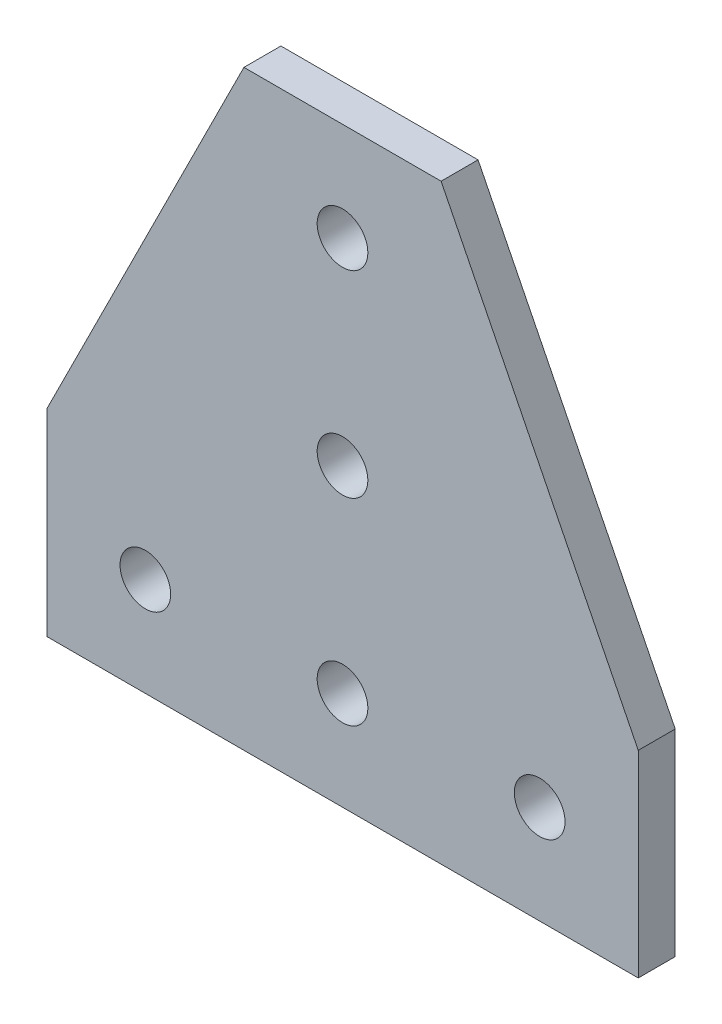
ISO-10303-21;
HEADER;
FILE_DESCRIPTION(('STEP AP214'),'2;1');
FILE_NAME('part.step','',(''),(''),'','','');
FILE_SCHEMA(('AUTOMOTIVE_DESIGN { 1 0 10303 214 1 1 1 1 }'));
ENDSEC;
DATA;
#1=APPLICATION_CONTEXT('core data for automotive mechanical design processes');
#2=APPLICATION_PROTOCOL_DEFINITION('international standard','automotive_design',2000,#1);
#3=PRODUCT_CONTEXT('',#1,'mechanical');
#4=PRODUCT('Part','Part','',(#3));
#5=PRODUCT_RELATED_PRODUCT_CATEGORY('part','',(#4));
#6=PRODUCT_DEFINITION_FORMATION('','',#4);
#7=PRODUCT_DEFINITION_CONTEXT('part definition',#1,'design');
#8=PRODUCT_DEFINITION('design','',#6,#7);
#9=PRODUCT_DEFINITION_SHAPE('','',#8);
#10=(LENGTH_UNIT() NAMED_UNIT(*) SI_UNIT(.MILLI.,.METRE.));
#11=(NAMED_UNIT(*) PLANE_ANGLE_UNIT() SI_UNIT($,.RADIAN.));
#12=(NAMED_UNIT(*) SI_UNIT($,.STERADIAN.) SOLID_ANGLE_UNIT());
#13=UNCERTAINTY_MEASURE_WITH_UNIT(LENGTH_MEASURE(1.E-05),#10,'distance_accuracy_value','');
#14=(GEOMETRIC_REPRESENTATION_CONTEXT(3) GLOBAL_UNCERTAINTY_ASSIGNED_CONTEXT((#13)) GLOBAL_UNIT_ASSIGNED_CONTEXT((#10,
#11,#12)) REPRESENTATION_CONTEXT('',''));
#15=CARTESIAN_POINT('',(0.,0.,0.));
#16=DIRECTION('',(0.,0.,1.));
#17=DIRECTION('',(1.,0.,0.));
#18=AXIS2_PLACEMENT_3D('',#15,#16,#17);
#19=CARTESIAN_POINT('',(0.,0.,2.38125));
#20=DIRECTION('',(0.,0.,-1.));
#21=DIRECTION('',(-1.,0.,0.));
#22=AXIS2_PLACEMENT_3D('',#19,#20,#21);
#23=PLANE('',#22);
#24=CARTESIAN_POINT('',(38.1,63.5,2.38125));
#25=DIRECTION('',(0.,0.,1.));
#26=DIRECTION('',(1.,0.,0.));
#27=AXIS2_PLACEMENT_3D('',#24,#25,#26);
#28=CIRCLE('',#27,3.26390000000001);
#29=CARTESIAN_POINT('',(41.3639,63.5,2.38125));
#30=VERTEX_POINT('',#29);
#31=EDGE_CURVE('E197',#30,#30,#28,.T.);
#32=ORIENTED_EDGE('',*,*,#31,.F.);
#33=EDGE_LOOP('',(#32));
#34=FACE_BOUND('',#33,.T.);
#35=CARTESIAN_POINT('',(38.1,12.7,2.38125));
#36=DIRECTION('',(0.,0.,1.));
#37=DIRECTION('',(1.,0.,0.));
#38=AXIS2_PLACEMENT_3D('',#35,#36,#37);
#39=CIRCLE('',#38,3.26389999999999);
#40=CARTESIAN_POINT('',(41.3639,12.7,2.38125));
#41=VERTEX_POINT('',#40);
#42=EDGE_CURVE('E209',#41,#41,#39,.T.);
#43=ORIENTED_EDGE('',*,*,#42,.F.);
#44=EDGE_LOOP('',(#43));
#45=FACE_BOUND('',#44,.T.);
#46=DIRECTION('',(1.,0.,0.));
#47=VECTOR('',#46,1.);
#48=CARTESIAN_POINT('',(76.2,0.,2.38125));
#49=LINE('',#48,#47);
#50=CARTESIAN_POINT('',(0.,0.,2.38125));
#51=VERTEX_POINT('',#50);
#52=CARTESIAN_POINT('',(76.2,0.,2.38125));
#53=VERTEX_POINT('',#52);
#54=EDGE_CURVE('E132',#51,#53,#49,.T.);
#55=ORIENTED_EDGE('',*,*,#54,.T.);
#56=DIRECTION('',(0.,1.,0.));
#57=VECTOR('',#56,1.);
#58=CARTESIAN_POINT('',(76.2,25.4,2.38125));
#59=LINE('',#58,#57);
#60=CARTESIAN_POINT('',(76.2,25.4,2.38125));
#61=VERTEX_POINT('',#60);
#62=EDGE_CURVE('E90',#53,#61,#59,.T.);
#63=ORIENTED_EDGE('',*,*,#62,.T.);
#64=DIRECTION('',(-0.447213595499958,0.894427190999916,0.));
#65=VECTOR('',#64,1.);
#66=CARTESIAN_POINT('',(76.2,25.4,2.38125));
#67=LINE('',#66,#65);
#68=CARTESIAN_POINT('',(50.8,76.2,2.38125));
#69=VERTEX_POINT('',#68);
#70=EDGE_CURVE('E103',#61,#69,#67,.T.);
#71=ORIENTED_EDGE('',*,*,#70,.T.);
#72=DIRECTION('',(-1.,0.,0.));
#73=VECTOR('',#72,1.);
#74=CARTESIAN_POINT('',(25.4,76.2,2.38125));
#75=LINE('',#74,#73);
#76=CARTESIAN_POINT('',(25.4,76.2,2.38125));
#77=VERTEX_POINT('',#76);
#78=EDGE_CURVE('E97',#69,#77,#75,.T.);
#79=ORIENTED_EDGE('',*,*,#78,.T.);
#80=DIRECTION('',(-0.447213595499958,-0.894427190999916,0.));
#81=VECTOR('',#80,1.);
#82=CARTESIAN_POINT('',(0.,25.4,2.38125));
#83=LINE('',#82,#81);
#84=CARTESIAN_POINT('',(0.,25.4,2.38125));
#85=VERTEX_POINT('',#84);
#86=EDGE_CURVE('E101',#77,#85,#83,.T.);
#87=ORIENTED_EDGE('',*,*,#86,.T.);
#88=DIRECTION('',(0.,-1.,0.));
#89=VECTOR('',#88,1.);
#90=CARTESIAN_POINT('',(0.,0.,2.38125));
#91=LINE('',#90,#89);
#92=EDGE_CURVE('E53',#85,#51,#91,.T.);
#93=ORIENTED_EDGE('',*,*,#92,.T.);
#94=EDGE_LOOP('',(#55,#63,#71,#79,#87,#93));
#95=FACE_BOUND('',#94,.T.);
#96=CARTESIAN_POINT('',(12.7,12.7,2.38125));
#97=DIRECTION('',(0.,0.,1.));
#98=DIRECTION('',(1.,0.,0.));
#99=AXIS2_PLACEMENT_3D('',#96,#97,#98);
#100=CIRCLE('',#99,3.2639);
#101=CARTESIAN_POINT('',(15.9639,12.7,2.38125));
#102=VERTEX_POINT('',#101);
#103=EDGE_CURVE('E125',#102,#102,#100,.T.);
#104=ORIENTED_EDGE('',*,*,#103,.F.);
#105=EDGE_LOOP('',(#104));
#106=FACE_BOUND('',#105,.T.);
#107=CARTESIAN_POINT('',(63.5,12.7,2.38125));
#108=DIRECTION('',(0.,0.,1.));
#109=DIRECTION('',(1.,0.,0.));
#110=AXIS2_PLACEMENT_3D('',#107,#108,#109);
#111=CIRCLE('',#110,3.26389999999999);
#112=CARTESIAN_POINT('',(66.7639,12.7,2.38125));
#113=VERTEX_POINT('',#112);
#114=EDGE_CURVE('E203',#113,#113,#111,.T.);
#115=ORIENTED_EDGE('',*,*,#114,.F.);
#116=EDGE_LOOP('',(#115));
#117=FACE_BOUND('',#116,.T.);
#118=CARTESIAN_POINT('',(38.1,38.1,2.38125));
#119=DIRECTION('',(0.,0.,1.));
#120=DIRECTION('',(1.,0.,0.));
#121=AXIS2_PLACEMENT_3D('',#118,#119,#120);
#122=CIRCLE('',#121,3.26389999999999);
#123=CARTESIAN_POINT('',(41.3639,38.1,2.38125));
#124=VERTEX_POINT('',#123);
#125=EDGE_CURVE('E188',#124,#124,#122,.T.);
#126=ORIENTED_EDGE('',*,*,#125,.F.);
#127=EDGE_LOOP('',(#126));
#128=FACE_BOUND('',#127,.T.);
#129=ADVANCED_FACE('F36',(#34,#45,#95,#106,#117,#128),#23,.F.);
#130=CARTESIAN_POINT('',(0.,0.,-2.38125));
#131=DIRECTION('',(0.,0.,-1.));
#132=DIRECTION('',(-1.,0.,0.));
#133=AXIS2_PLACEMENT_3D('',#130,#131,#132);
#134=PLANE('',#133);
#135=CARTESIAN_POINT('',(38.1,63.5,-2.38125));
#136=DIRECTION('',(0.,0.,1.));
#137=DIRECTION('',(1.,0.,0.));
#138=AXIS2_PLACEMENT_3D('',#135,#136,#137);
#139=CIRCLE('',#138,3.26390000000001);
#140=CARTESIAN_POINT('',(41.3639,63.5,-2.38125));
#141=VERTEX_POINT('',#140);
#142=EDGE_CURVE('E194',#141,#141,#139,.T.);
#143=ORIENTED_EDGE('',*,*,#142,.T.);
#144=EDGE_LOOP('',(#143));
#145=FACE_BOUND('',#144,.T.);
#146=CARTESIAN_POINT('',(38.1,12.7,-2.38125));
#147=DIRECTION('',(0.,0.,1.));
#148=DIRECTION('',(1.,0.,0.));
#149=AXIS2_PLACEMENT_3D('',#146,#147,#148);
#150=CIRCLE('',#149,3.26389999999999);
#151=CARTESIAN_POINT('',(41.3639,12.7,-2.38125));
#152=VERTEX_POINT('',#151);
#153=EDGE_CURVE('E206',#152,#152,#150,.T.);
#154=ORIENTED_EDGE('',*,*,#153,.T.);
#155=EDGE_LOOP('',(#154));
#156=FACE_BOUND('',#155,.T.);
#157=DIRECTION('',(1.,0.,0.));
#158=VECTOR('',#157,1.);
#159=CARTESIAN_POINT('',(76.2,0.,-2.38125));
#160=LINE('',#159,#158);
#161=CARTESIAN_POINT('',(0.,0.,-2.38125));
#162=VERTEX_POINT('',#161);
#163=CARTESIAN_POINT('',(76.2,0.,-2.38125));
#164=VERTEX_POINT('',#163);
#165=EDGE_CURVE('E121',#162,#164,#160,.T.);
#166=ORIENTED_EDGE('',*,*,#165,.F.);
#167=DIRECTION('',(0.,-1.,0.));
#168=VECTOR('',#167,1.);
#169=CARTESIAN_POINT('',(0.,0.,-2.38125));
#170=LINE('',#169,#168);
#171=CARTESIAN_POINT('',(0.,25.4,-2.38125));
#172=VERTEX_POINT('',#171);
#173=EDGE_CURVE('E82',#172,#162,#170,.T.);
#174=ORIENTED_EDGE('',*,*,#173,.F.);
#175=DIRECTION('',(-0.447213595499958,-0.894427190999916,0.));
#176=VECTOR('',#175,1.);
#177=CARTESIAN_POINT('',(0.,25.4,-2.38125));
#178=LINE('',#177,#176);
#179=CARTESIAN_POINT('',(25.4,76.2,-2.38125));
#180=VERTEX_POINT('',#179);
#181=EDGE_CURVE('E76',#180,#172,#178,.T.);
#182=ORIENTED_EDGE('',*,*,#181,.F.);
#183=DIRECTION('',(-1.,0.,0.));
#184=VECTOR('',#183,1.);
#185=CARTESIAN_POINT('',(25.4,76.2,-2.38125));
#186=LINE('',#185,#184);
#187=CARTESIAN_POINT('',(50.8,76.2,-2.38125));
#188=VERTEX_POINT('',#187);
#189=EDGE_CURVE('E111',#188,#180,#186,.T.);
#190=ORIENTED_EDGE('',*,*,#189,.F.);
#191=DIRECTION('',(-0.447213595499958,0.894427190999916,0.));
#192=VECTOR('',#191,1.);
#193=CARTESIAN_POINT('',(76.2,25.4,-2.38125));
#194=LINE('',#193,#192);
#195=CARTESIAN_POINT('',(76.2,25.4,-2.38125));
#196=VERTEX_POINT('',#195);
#197=EDGE_CURVE('E127',#196,#188,#194,.T.);
#198=ORIENTED_EDGE('',*,*,#197,.F.);
#199=DIRECTION('',(0.,1.,0.));
#200=VECTOR('',#199,1.);
#201=CARTESIAN_POINT('',(76.2,25.4,-2.38125));
#202=LINE('',#201,#200);
#203=EDGE_CURVE('E124',#164,#196,#202,.T.);
#204=ORIENTED_EDGE('',*,*,#203,.F.);
#205=EDGE_LOOP('',(#166,#174,#182,#190,#198,#204));
#206=FACE_BOUND('',#205,.T.);
#207=CARTESIAN_POINT('',(12.7,12.7,-2.38125));
#208=DIRECTION('',(0.,0.,1.));
#209=DIRECTION('',(1.,0.,0.));
#210=AXIS2_PLACEMENT_3D('',#207,#208,#209);
#211=CIRCLE('',#210,3.2639);
#212=CARTESIAN_POINT('',(15.9639,12.7,-2.38125));
#213=VERTEX_POINT('',#212);
#214=EDGE_CURVE('E212',#213,#213,#211,.T.);
#215=ORIENTED_EDGE('',*,*,#214,.T.);
#216=EDGE_LOOP('',(#215));
#217=FACE_BOUND('',#216,.T.);
#218=CARTESIAN_POINT('',(63.5,12.7,-2.38125));
#219=DIRECTION('',(0.,0.,1.));
#220=DIRECTION('',(1.,0.,0.));
#221=AXIS2_PLACEMENT_3D('',#218,#219,#220);
#222=CIRCLE('',#221,3.26389999999999);
#223=CARTESIAN_POINT('',(66.7639,12.7,-2.38125));
#224=VERTEX_POINT('',#223);
#225=EDGE_CURVE('E200',#224,#224,#222,.T.);
#226=ORIENTED_EDGE('',*,*,#225,.T.);
#227=EDGE_LOOP('',(#226));
#228=FACE_BOUND('',#227,.T.);
#229=CARTESIAN_POINT('',(38.1,38.1,-2.38125));
#230=DIRECTION('',(0.,0.,1.));
#231=DIRECTION('',(1.,0.,0.));
#232=AXIS2_PLACEMENT_3D('',#229,#230,#231);
#233=CIRCLE('',#232,3.26389999999999);
#234=CARTESIAN_POINT('',(41.3639,38.1,-2.38125));
#235=VERTEX_POINT('',#234);
#236=EDGE_CURVE('E191',#235,#235,#233,.T.);
#237=ORIENTED_EDGE('',*,*,#236,.T.);
#238=EDGE_LOOP('',(#237));
#239=FACE_BOUND('',#238,.T.);
#240=ADVANCED_FACE('F141',(#145,#156,#206,#217,#228,#239),#134,.T.);
#241=CARTESIAN_POINT('',(76.2,0.,2.38125));
#242=DIRECTION('',(0.,1.,0.));
#243=DIRECTION('',(-1.,0.,0.));
#244=AXIS2_PLACEMENT_3D('',#241,#242,#243);
#245=PLANE('',#244);
#246=ORIENTED_EDGE('',*,*,#165,.T.);
#247=DIRECTION('',(0.,0.,-1.));
#248=VECTOR('',#247,1.);
#249=CARTESIAN_POINT('',(76.2,0.,2.38125));
#250=LINE('',#249,#248);
#251=EDGE_CURVE('E11',#53,#164,#250,.T.);
#252=ORIENTED_EDGE('',*,*,#251,.F.);
#253=ORIENTED_EDGE('',*,*,#54,.F.);
#254=DIRECTION('',(0.,0.,-1.));
#255=VECTOR('',#254,1.);
#256=CARTESIAN_POINT('',(0.,0.,2.38125));
#257=LINE('',#256,#255);
#258=EDGE_CURVE('E117',#51,#162,#257,.T.);
#259=ORIENTED_EDGE('',*,*,#258,.T.);
#260=EDGE_LOOP('',(#246,#252,#253,#259));
#261=FACE_BOUND('',#260,.T.);
#262=ADVANCED_FACE('F38',(#261),#245,.F.);
#263=CARTESIAN_POINT('',(76.2,25.4,2.38125));
#264=DIRECTION('',(-1.,0.,0.));
#265=DIRECTION('',(0.,0.,1.));
#266=AXIS2_PLACEMENT_3D('',#263,#264,#265);
#267=PLANE('',#266);
#268=ORIENTED_EDGE('',*,*,#203,.T.);
#269=DIRECTION('',(0.,0.,-1.));
#270=VECTOR('',#269,1.);
#271=CARTESIAN_POINT('',(76.2,25.4,2.38125));
#272=LINE('',#271,#270);
#273=EDGE_CURVE('E45',#61,#196,#272,.T.);
#274=ORIENTED_EDGE('',*,*,#273,.F.);
#275=ORIENTED_EDGE('',*,*,#62,.F.);
#276=ORIENTED_EDGE('',*,*,#251,.T.);
#277=EDGE_LOOP('',(#268,#274,#275,#276));
#278=FACE_BOUND('',#277,.T.);
#279=ADVANCED_FACE('F278',(#278),#267,.F.);
#280=CARTESIAN_POINT('',(76.2,25.4,2.38125));
#281=DIRECTION('',(-0.894427190999916,-0.447213595499958,0.));
#282=DIRECTION('',(0.447213595499958,-0.894427190999916,0.));
#283=AXIS2_PLACEMENT_3D('',#280,#281,#282);
#284=PLANE('',#283);
#285=ORIENTED_EDGE('',*,*,#197,.T.);
#286=DIRECTION('',(0.,0.,-1.));
#287=VECTOR('',#286,1.);
#288=CARTESIAN_POINT('',(50.8,76.2,2.38125));
#289=LINE('',#288,#287);
#290=EDGE_CURVE('E112',#69,#188,#289,.T.);
#291=ORIENTED_EDGE('',*,*,#290,.F.);
#292=ORIENTED_EDGE('',*,*,#70,.F.);
#293=ORIENTED_EDGE('',*,*,#273,.T.);
#294=EDGE_LOOP('',(#285,#291,#292,#293));
#295=FACE_BOUND('',#294,.T.);
#296=ADVANCED_FACE('F138',(#295),#284,.F.);
#297=CARTESIAN_POINT('',(25.4,76.2,2.38125));
#298=DIRECTION('',(0.,-1.,0.));
#299=DIRECTION('',(0.,0.,-1.));
#300=AXIS2_PLACEMENT_3D('',#297,#298,#299);
#301=PLANE('',#300);
#302=ORIENTED_EDGE('',*,*,#189,.T.);
#303=DIRECTION('',(0.,0.,-1.));
#304=VECTOR('',#303,1.);
#305=CARTESIAN_POINT('',(25.4,76.2,2.38125));
#306=LINE('',#305,#304);
#307=EDGE_CURVE('E108',#77,#180,#306,.T.);
#308=ORIENTED_EDGE('',*,*,#307,.F.);
#309=ORIENTED_EDGE('',*,*,#78,.F.);
#310=ORIENTED_EDGE('',*,*,#290,.T.);
#311=EDGE_LOOP('',(#302,#308,#309,#310));
#312=FACE_BOUND('',#311,.T.);
#313=ADVANCED_FACE('F109',(#312),#301,.F.);
#314=CARTESIAN_POINT('',(0.,25.4,2.38125));
#315=DIRECTION('',(0.894427190999916,-0.447213595499958,0.));
#316=DIRECTION('',(0.447213595499958,0.894427190999916,0.));
#317=AXIS2_PLACEMENT_3D('',#314,#315,#316);
#318=PLANE('',#317);
#319=ORIENTED_EDGE('',*,*,#181,.T.);
#320=DIRECTION('',(0.,0.,-1.));
#321=VECTOR('',#320,1.);
#322=CARTESIAN_POINT('',(0.,25.4,2.38125));
#323=LINE('',#322,#321);
#324=EDGE_CURVE('E113',#85,#172,#323,.T.);
#325=ORIENTED_EDGE('',*,*,#324,.F.);
#326=ORIENTED_EDGE('',*,*,#86,.F.);
#327=ORIENTED_EDGE('',*,*,#307,.T.);
#328=EDGE_LOOP('',(#319,#325,#326,#327));
#329=FACE_BOUND('',#328,.T.);
#330=ADVANCED_FACE('F115',(#329),#318,.F.);
#331=CARTESIAN_POINT('',(0.,0.,2.38125));
#332=DIRECTION('',(1.,0.,0.));
#333=DIRECTION('',(0.,0.,-1.));
#334=AXIS2_PLACEMENT_3D('',#331,#332,#333);
#335=PLANE('',#334);
#336=ORIENTED_EDGE('',*,*,#173,.T.);
#337=ORIENTED_EDGE('',*,*,#258,.F.);
#338=ORIENTED_EDGE('',*,*,#92,.F.);
#339=ORIENTED_EDGE('',*,*,#324,.T.);
#340=EDGE_LOOP('',(#336,#337,#338,#339));
#341=FACE_BOUND('',#340,.T.);
#342=ADVANCED_FACE('F146',(#341),#335,.F.);
#343=CARTESIAN_POINT('',(12.7,12.7,2.38125));
#344=DIRECTION('',(0.,0.,-1.));
#345=DIRECTION('',(-1.,0.,0.));
#346=AXIS2_PLACEMENT_3D('',#343,#344,#345);
#347=CYLINDRICAL_SURFACE('',#346,3.2639);
#348=ORIENTED_EDGE('',*,*,#103,.T.);
#349=EDGE_LOOP('',(#348));
#350=FACE_BOUND('',#349,.T.);
#351=ORIENTED_EDGE('',*,*,#214,.F.);
#352=EDGE_LOOP('',(#351));
#353=FACE_BOUND('',#352,.T.);
#354=ADVANCED_FACE('F148',(#350,#353),#347,.F.);
#355=CARTESIAN_POINT('',(38.1,12.7,2.38125));
#356=DIRECTION('',(0.,0.,-1.));
#357=DIRECTION('',(-1.,0.,0.));
#358=AXIS2_PLACEMENT_3D('',#355,#356,#357);
#359=CYLINDRICAL_SURFACE('',#358,3.26389999999999);
#360=ORIENTED_EDGE('',*,*,#42,.T.);
#361=EDGE_LOOP('',(#360));
#362=FACE_BOUND('',#361,.T.);
#363=ORIENTED_EDGE('',*,*,#153,.F.);
#364=EDGE_LOOP('',(#363));
#365=FACE_BOUND('',#364,.T.);
#366=ADVANCED_FACE('F154',(#362,#365),#359,.F.);
#367=CARTESIAN_POINT('',(63.5,12.7,2.38125));
#368=DIRECTION('',(0.,0.,-1.));
#369=DIRECTION('',(-1.,0.,0.));
#370=AXIS2_PLACEMENT_3D('',#367,#368,#369);
#371=CYLINDRICAL_SURFACE('',#370,3.26389999999999);
#372=ORIENTED_EDGE('',*,*,#114,.T.);
#373=EDGE_LOOP('',(#372));
#374=FACE_BOUND('',#373,.T.);
#375=ORIENTED_EDGE('',*,*,#225,.F.);
#376=EDGE_LOOP('',(#375));
#377=FACE_BOUND('',#376,.T.);
#378=ADVANCED_FACE('F171',(#374,#377),#371,.F.);
#379=CARTESIAN_POINT('',(38.1,63.5,2.38125));
#380=DIRECTION('',(0.,0.,-1.));
#381=DIRECTION('',(-1.,0.,0.));
#382=AXIS2_PLACEMENT_3D('',#379,#380,#381);
#383=CYLINDRICAL_SURFACE('',#382,3.26390000000001);
#384=ORIENTED_EDGE('',*,*,#31,.T.);
#385=EDGE_LOOP('',(#384));
#386=FACE_BOUND('',#385,.T.);
#387=ORIENTED_EDGE('',*,*,#142,.F.);
#388=EDGE_LOOP('',(#387));
#389=FACE_BOUND('',#388,.T.);
#390=ADVANCED_FACE('F175',(#386,#389),#383,.F.);
#391=CARTESIAN_POINT('',(38.1,38.1,2.38125));
#392=DIRECTION('',(0.,0.,-1.));
#393=DIRECTION('',(-1.,0.,0.));
#394=AXIS2_PLACEMENT_3D('',#391,#392,#393);
#395=CYLINDRICAL_SURFACE('',#394,3.26389999999999);
#396=ORIENTED_EDGE('',*,*,#125,.T.);
#397=EDGE_LOOP('',(#396));
#398=FACE_BOUND('',#397,.T.);
#399=ORIENTED_EDGE('',*,*,#236,.F.);
#400=EDGE_LOOP('',(#399));
#401=FACE_BOUND('',#400,.T.);
#402=ADVANCED_FACE('F179',(#398,#401),#395,.F.);
#403=CLOSED_SHELL('',(#129,#240,#262,#279,#296,#313,#330,#342,#354,#366,#378,#390,#402));
#404=MANIFOLD_SOLID_BREP('B2',#403);
#405=ADVANCED_BREP_SHAPE_REPRESENTATION('',(#18,#404),#14);
#406=SHAPE_DEFINITION_REPRESENTATION(#9,#405);
ENDSEC;
END-ISO-10303-21;
